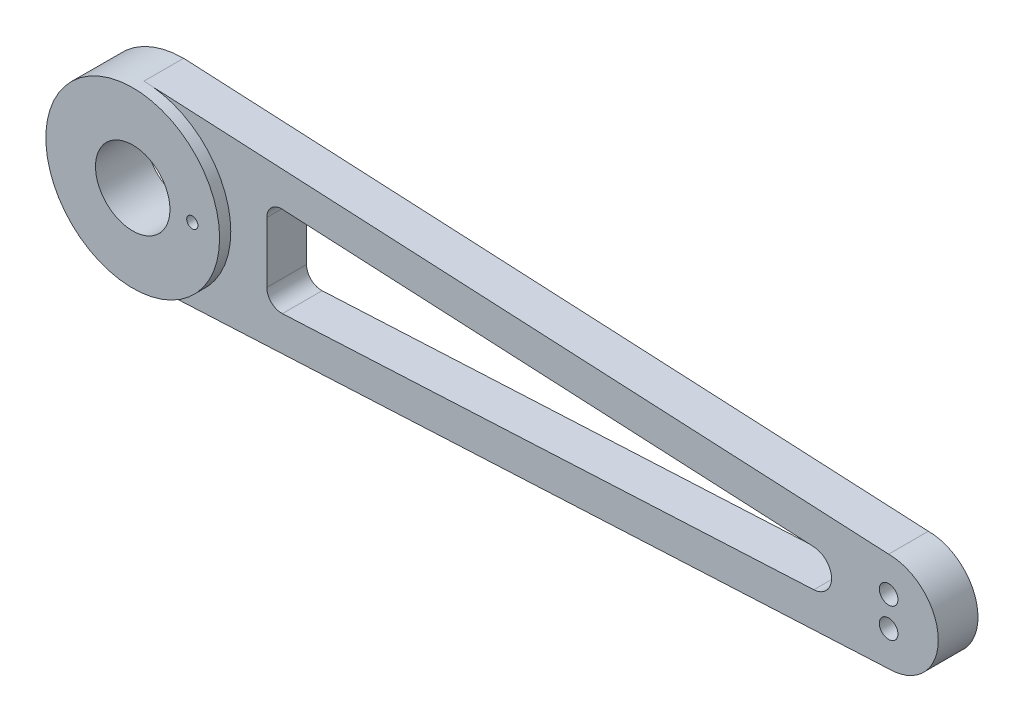
ISO-10303-21;
HEADER;
FILE_DESCRIPTION(('STEP AP214'),'2;1');
FILE_NAME('part.step','',(''),(''),'','','');
FILE_SCHEMA(('AUTOMOTIVE_DESIGN { 1 0 10303 214 1 1 1 1 }'));
ENDSEC;
DATA;
#1=APPLICATION_CONTEXT('core data for automotive mechanical design processes');
#2=APPLICATION_PROTOCOL_DEFINITION('international standard','automotive_design',2000,#1);
#3=PRODUCT_CONTEXT('',#1,'mechanical');
#4=PRODUCT('Part','Part','',(#3));
#5=PRODUCT_RELATED_PRODUCT_CATEGORY('part','',(#4));
#6=PRODUCT_DEFINITION_FORMATION('','',#4);
#7=PRODUCT_DEFINITION_CONTEXT('part definition',#1,'design');
#8=PRODUCT_DEFINITION('design','',#6,#7);
#9=PRODUCT_DEFINITION_SHAPE('','',#8);
#10=(LENGTH_UNIT() NAMED_UNIT(*) SI_UNIT(.MILLI.,.METRE.));
#11=(NAMED_UNIT(*) PLANE_ANGLE_UNIT() SI_UNIT($,.RADIAN.));
#12=(NAMED_UNIT(*) SI_UNIT($,.STERADIAN.) SOLID_ANGLE_UNIT());
#13=UNCERTAINTY_MEASURE_WITH_UNIT(LENGTH_MEASURE(1.E-05),#10,'distance_accuracy_value','');
#14=(GEOMETRIC_REPRESENTATION_CONTEXT(3) GLOBAL_UNCERTAINTY_ASSIGNED_CONTEXT((#13)) GLOBAL_UNIT_ASSIGNED_CONTEXT((#10,
#11,#12)) REPRESENTATION_CONTEXT('',''));
#15=CARTESIAN_POINT('',(0.,0.,0.));
#16=DIRECTION('',(0.,0.,1.));
#17=DIRECTION('',(1.,0.,0.));
#18=AXIS2_PLACEMENT_3D('',#15,#16,#17);
#19=CARTESIAN_POINT('',(302.25,41.,10.));
#20=DIRECTION('',(0.,0.,-1.));
#21=DIRECTION('',(-1.,0.,0.));
#22=AXIS2_PLACEMENT_3D('',#19,#20,#21);
#23=PLANE('',#22);
#24=CARTESIAN_POINT('',(300.,41.,10.));
#25=DIRECTION('',(0.,0.,1.));
#26=DIRECTION('',(1.,0.,0.));
#27=AXIS2_PLACEMENT_3D('',#24,#25,#26);
#28=CIRCLE('',#27,2.25);
#29=CARTESIAN_POINT('',(302.25,41.,10.));
#30=VERTEX_POINT('',#29);
#31=EDGE_CURVE('E19',#30,#30,#28,.F.);
#32=ORIENTED_EDGE('',*,*,#31,.T.);
#33=EDGE_LOOP('',(#32));
#34=FACE_BOUND('',#33,.T.);
#35=CARTESIAN_POINT('',(300.,41.,10.));
#36=DIRECTION('',(0.,0.,1.));
#37=DIRECTION('',(1.,0.,0.));
#38=AXIS2_PLACEMENT_3D('',#35,#36,#37);
#39=CIRCLE('',#38,3.75);
#40=CARTESIAN_POINT('',(303.75,41.,10.));
#41=VERTEX_POINT('',#40);
#42=EDGE_CURVE('E204',#41,#41,#39,.T.);
#43=ORIENTED_EDGE('',*,*,#42,.T.);
#44=EDGE_LOOP('',(#43));
#45=FACE_BOUND('',#44,.T.);
#46=ADVANCED_FACE('F16',(#34,#45),#23,.F.);
#47=CARTESIAN_POINT('',(302.25,29.,10.));
#48=DIRECTION('',(0.,0.,-1.));
#49=DIRECTION('',(-1.,0.,0.));
#50=AXIS2_PLACEMENT_3D('',#47,#48,#49);
#51=PLANE('',#50);
#52=CARTESIAN_POINT('',(300.,29.,10.));
#53=DIRECTION('',(0.,0.,1.));
#54=DIRECTION('',(1.,0.,0.));
#55=AXIS2_PLACEMENT_3D('',#52,#53,#54);
#56=CIRCLE('',#55,2.25);
#57=CARTESIAN_POINT('',(302.25,29.,10.));
#58=VERTEX_POINT('',#57);
#59=EDGE_CURVE('E206',#58,#58,#56,.F.);
#60=ORIENTED_EDGE('',*,*,#59,.T.);
#61=EDGE_LOOP('',(#60));
#62=FACE_BOUND('',#61,.T.);
#63=CARTESIAN_POINT('',(300.,29.,10.));
#64=DIRECTION('',(0.,0.,1.));
#65=DIRECTION('',(1.,0.,0.));
#66=AXIS2_PLACEMENT_3D('',#63,#64,#65);
#67=CIRCLE('',#66,3.75);
#68=CARTESIAN_POINT('',(303.75,29.,10.));
#69=VERTEX_POINT('',#68);
#70=EDGE_CURVE('E137',#69,#69,#67,.T.);
#71=ORIENTED_EDGE('',*,*,#70,.T.);
#72=EDGE_LOOP('',(#71));
#73=FACE_BOUND('',#72,.T.);
#74=ADVANCED_FACE('F219',(#62,#73),#51,.F.);
#75=CARTESIAN_POINT('',(300.,41.,16.));
#76=DIRECTION('',(0.,0.,1.));
#77=DIRECTION('',(1.,0.,0.));
#78=AXIS2_PLACEMENT_3D('',#75,#76,#77);
#79=CYLINDRICAL_SURFACE('',#78,2.25);
#80=ORIENTED_EDGE('',*,*,#31,.F.);
#81=EDGE_LOOP('',(#80));
#82=FACE_BOUND('',#81,.T.);
#83=CARTESIAN_POINT('',(300.,41.,5.));
#84=DIRECTION('',(0.,0.,1.));
#85=DIRECTION('',(1.,0.,0.));
#86=AXIS2_PLACEMENT_3D('',#83,#84,#85);
#87=CIRCLE('',#86,2.25);
#88=CARTESIAN_POINT('',(302.25,41.,5.));
#89=VERTEX_POINT('',#88);
#90=EDGE_CURVE('E136',#89,#89,#87,.T.);
#91=ORIENTED_EDGE('',*,*,#90,.F.);
#92=EDGE_LOOP('',(#91));
#93=FACE_BOUND('',#92,.T.);
#94=ADVANCED_FACE('F215',(#82,#93),#79,.F.);
#95=CARTESIAN_POINT('',(300.,29.,16.));
#96=DIRECTION('',(0.,0.,1.));
#97=DIRECTION('',(1.,0.,0.));
#98=AXIS2_PLACEMENT_3D('',#95,#96,#97);
#99=CYLINDRICAL_SURFACE('',#98,2.25);
#100=ORIENTED_EDGE('',*,*,#59,.F.);
#101=EDGE_LOOP('',(#100));
#102=FACE_BOUND('',#101,.T.);
#103=CARTESIAN_POINT('',(300.,29.,5.));
#104=DIRECTION('',(0.,0.,1.));
#105=DIRECTION('',(1.,0.,0.));
#106=AXIS2_PLACEMENT_3D('',#103,#104,#105);
#107=CIRCLE('',#106,2.25);
#108=CARTESIAN_POINT('',(302.25,29.,5.));
#109=VERTEX_POINT('',#108);
#110=EDGE_CURVE('E197',#109,#109,#107,.T.);
#111=ORIENTED_EDGE('',*,*,#110,.F.);
#112=EDGE_LOOP('',(#111));
#113=FACE_BOUND('',#112,.T.);
#114=ADVANCED_FACE('F218',(#102,#113),#99,.F.);
#115=CARTESIAN_POINT('',(24.,35.,0.));
#116=DIRECTION('',(0.,0.,-1.));
#117=DIRECTION('',(-1.,0.,0.));
#118=AXIS2_PLACEMENT_3D('',#115,#116,#117);
#119=CYLINDRICAL_SURFACE('',#118,2.25);
#120=CARTESIAN_POINT('',(24.,35.,17.1502151547998));
#121=DIRECTION('',(0.,0.,-1.));
#122=DIRECTION('',(-1.,0.,0.));
#123=AXIS2_PLACEMENT_3D('',#120,#121,#122);
#124=CIRCLE('',#123,2.25000000000273);
#125=CARTESIAN_POINT('',(21.7499999999973,35.,17.1502151547998));
#126=VERTEX_POINT('',#125);
#127=EDGE_CURVE('E133',#126,#126,#124,.T.);
#128=ORIENTED_EDGE('',*,*,#127,.T.);
#129=EDGE_LOOP('',(#128));
#130=FACE_BOUND('',#129,.T.);
#131=CARTESIAN_POINT('',(24.,35.,20.5));
#132=DIRECTION('',(0.,0.,-1.));
#133=DIRECTION('',(-1.,0.,0.));
#134=AXIS2_PLACEMENT_3D('',#131,#132,#133);
#135=CIRCLE('',#134,2.25);
#136=CARTESIAN_POINT('',(21.75,35.,20.5));
#137=VERTEX_POINT('',#136);
#138=EDGE_CURVE('E194',#137,#137,#135,.T.);
#139=ORIENTED_EDGE('',*,*,#138,.F.);
#140=EDGE_LOOP('',(#139));
#141=FACE_BOUND('',#140,.T.);
#142=ADVANCED_FACE('F312',(#130,#141),#119,.F.);
#143=CARTESIAN_POINT('',(300.,41.,16.));
#144=DIRECTION('',(0.,0.,1.));
#145=DIRECTION('',(1.,0.,0.));
#146=AXIS2_PLACEMENT_3D('',#143,#144,#145);
#147=CYLINDRICAL_SURFACE('',#146,3.75);
#148=CARTESIAN_POINT('',(300.,41.,16.));
#149=DIRECTION('',(0.,0.,1.));
#150=DIRECTION('',(1.,0.,0.));
#151=AXIS2_PLACEMENT_3D('',#148,#149,#150);
#152=CIRCLE('',#151,3.75);
#153=CARTESIAN_POINT('',(303.75,41.,16.));
#154=VERTEX_POINT('',#153);
#155=EDGE_CURVE('E191',#154,#154,#152,.T.);
#156=ORIENTED_EDGE('',*,*,#155,.T.);
#157=EDGE_LOOP('',(#156));
#158=FACE_BOUND('',#157,.T.);
#159=ORIENTED_EDGE('',*,*,#42,.F.);
#160=EDGE_LOOP('',(#159));
#161=FACE_BOUND('',#160,.T.);
#162=ADVANCED_FACE('F315',(#158,#161),#147,.F.);
#163=CARTESIAN_POINT('',(300.,29.,16.));
#164=DIRECTION('',(0.,0.,1.));
#165=DIRECTION('',(1.,0.,0.));
#166=AXIS2_PLACEMENT_3D('',#163,#164,#165);
#167=CYLINDRICAL_SURFACE('',#166,3.75);
#168=CARTESIAN_POINT('',(300.,29.,16.));
#169=DIRECTION('',(0.,0.,1.));
#170=DIRECTION('',(1.,0.,0.));
#171=AXIS2_PLACEMENT_3D('',#168,#169,#170);
#172=CIRCLE('',#171,3.75);
#173=CARTESIAN_POINT('',(303.75,29.,16.));
#174=VERTEX_POINT('',#173);
#175=EDGE_CURVE('E105',#174,#174,#172,.T.);
#176=ORIENTED_EDGE('',*,*,#175,.T.);
#177=EDGE_LOOP('',(#176));
#178=FACE_BOUND('',#177,.T.);
#179=ORIENTED_EDGE('',*,*,#70,.F.);
#180=EDGE_LOOP('',(#179));
#181=FACE_BOUND('',#180,.T.);
#182=ADVANCED_FACE('F344',(#178,#181),#167,.F.);
#183=CARTESIAN_POINT('',(300.,70.,16.));
#184=DIRECTION('',(0.,0.,-1.));
#185=DIRECTION('',(-1.,0.,0.));
#186=AXIS2_PLACEMENT_3D('',#183,#184,#185);
#187=PLANE('',#186);
#188=CARTESIAN_POINT('',(0.,35.,16.));
#189=DIRECTION('',(0.,0.,1.));
#190=DIRECTION('',(1.,0.,0.));
#191=AXIS2_PLACEMENT_3D('',#188,#189,#190);
#192=CIRCLE('',#191,35.);
#193=CARTESIAN_POINT('',(3.49127182044882,69.8254364089776,16.));
#194=VERTEX_POINT('',#193);
#195=CARTESIAN_POINT('',(0.,70.,16.));
#196=VERTEX_POINT('',#195);
#197=EDGE_CURVE('E130',#194,#196,#192,.T.);
#198=ORIENTED_EDGE('',*,*,#197,.F.);
#199=DIRECTION('',(0.998752338877845,-0.0499376169438922,0.));
#200=VECTOR('',#199,1.);
#201=CARTESIAN_POINT('',(0.,70.,16.));
#202=LINE('',#201,#200);
#203=EDGE_CURVE('E129',#194,#196,#202,.F.);
#204=ORIENTED_EDGE('',*,*,#203,.T.);
#205=EDGE_LOOP('',(#198,#204));
#206=FACE_BOUND('',#205,.T.);
#207=ADVANCED_FACE('F341',(#206),#187,.T.);
#208=CARTESIAN_POINT('',(300.,0.,16.));
#209=DIRECTION('',(0.,0.,1.));
#210=DIRECTION('',(1.,0.,0.));
#211=AXIS2_PLACEMENT_3D('',#208,#209,#210);
#212=PLANE('',#211);
#213=CARTESIAN_POINT('',(0.,35.,16.));
#214=DIRECTION('',(0.,0.,1.));
#215=DIRECTION('',(1.,0.,0.));
#216=AXIS2_PLACEMENT_3D('',#213,#214,#215);
#217=CIRCLE('',#216,35.);
#218=CARTESIAN_POINT('',(0.,0.,16.));
#219=VERTEX_POINT('',#218);
#220=CARTESIAN_POINT('',(3.49127182044891,0.174563591022445,16.));
#221=VERTEX_POINT('',#220);
#222=EDGE_CURVE('E97',#219,#221,#217,.T.);
#223=ORIENTED_EDGE('',*,*,#222,.F.);
#224=DIRECTION('',(-0.998752338877845,-0.0499376169438922,0.));
#225=VECTOR('',#224,1.);
#226=CARTESIAN_POINT('',(0.,0.,16.));
#227=LINE('',#226,#225);
#228=EDGE_CURVE('E101',#219,#221,#227,.F.);
#229=ORIENTED_EDGE('',*,*,#228,.T.);
#230=EDGE_LOOP('',(#223,#229));
#231=FACE_BOUND('',#230,.T.);
#232=ADVANCED_FACE('F99',(#231),#212,.F.);
#233=CARTESIAN_POINT('',(24.,35.,17.0000000001664));
#234=DIRECTION('',(0.,0.,-1.));
#235=DIRECTION('',(-1.,0.,0.));
#236=AXIS2_PLACEMENT_3D('',#233,#234,#235);
#237=CONICAL_SURFACE('',#236,2.49999999976944,1.0297442585949);
#238=CARTESIAN_POINT('',(24.,35.,17.));
#239=DIRECTION('',(0.,0.,-1.));
#240=DIRECTION('',(-1.,0.,0.));
#241=AXIS2_PLACEMENT_3D('',#238,#239,#240);
#242=CIRCLE('',#241,2.5);
#243=CARTESIAN_POINT('',(21.5,35.,17.));
#244=VERTEX_POINT('',#243);
#245=EDGE_CURVE('E179',#244,#244,#242,.T.);
#246=ORIENTED_EDGE('',*,*,#245,.T.);
#247=EDGE_LOOP('',(#246));
#248=FACE_BOUND('',#247,.T.);
#249=ORIENTED_EDGE('',*,*,#127,.F.);
#250=EDGE_LOOP('',(#249));
#251=FACE_BOUND('',#250,.T.);
#252=ADVANCED_FACE('F227',(#248,#251),#237,.F.);
#253=CARTESIAN_POINT('',(300.,35.,5.));
#254=DIRECTION('',(0.,0.,-1.));
#255=DIRECTION('',(-1.,0.,0.));
#256=AXIS2_PLACEMENT_3D('',#253,#254,#255);
#257=PLANE('',#256);
#258=ORIENTED_EDGE('',*,*,#110,.T.);
#259=EDGE_LOOP('',(#258));
#260=FACE_BOUND('',#259,.T.);
#261=ORIENTED_EDGE('',*,*,#90,.T.);
#262=EDGE_LOOP('',(#261));
#263=FACE_BOUND('',#262,.T.);
#264=CARTESIAN_POINT('',(300.,35.,5.));
#265=DIRECTION('',(0.,0.,-1.));
#266=DIRECTION('',(-1.,0.,0.));
#267=AXIS2_PLACEMENT_3D('',#264,#265,#266);
#268=CIRCLE('',#267,12.);
#269=CARTESIAN_POINT('',(288.,35.,5.));
#270=VERTEX_POINT('',#269);
#271=EDGE_CURVE('E176',#270,#270,#268,.T.);
#272=ORIENTED_EDGE('',*,*,#271,.T.);
#273=EDGE_LOOP('',(#272));
#274=FACE_BOUND('',#273,.T.);
#275=ADVANCED_FACE('F223',(#260,#263,#274),#257,.T.);
#276=CARTESIAN_POINT('',(0.,35.,20.5));
#277=DIRECTION('',(0.,0.,1.));
#278=DIRECTION('',(1.,0.,0.));
#279=AXIS2_PLACEMENT_3D('',#276,#277,#278);
#280=PLANE('',#279);
#281=CARTESIAN_POINT('',(0.,35.,20.5));
#282=DIRECTION('',(0.,0.,1.));
#283=DIRECTION('',(1.,0.,0.));
#284=AXIS2_PLACEMENT_3D('',#281,#282,#283);
#285=CIRCLE('',#284,15.);
#286=CARTESIAN_POINT('',(15.,35.,20.5));
#287=VERTEX_POINT('',#286);
#288=EDGE_CURVE('E173',#287,#287,#285,.F.);
#289=ORIENTED_EDGE('',*,*,#288,.T.);
#290=EDGE_LOOP('',(#289));
#291=FACE_BOUND('',#290,.T.);
#292=ORIENTED_EDGE('',*,*,#138,.T.);
#293=EDGE_LOOP('',(#292));
#294=FACE_BOUND('',#293,.T.);
#295=CARTESIAN_POINT('',(0.,35.,20.5));
#296=DIRECTION('',(0.,0.,1.));
#297=DIRECTION('',(1.,0.,0.));
#298=AXIS2_PLACEMENT_3D('',#295,#296,#297);
#299=CIRCLE('',#298,35.);
#300=CARTESIAN_POINT('',(35.,35.,20.5));
#301=VERTEX_POINT('',#300);
#302=EDGE_CURVE('E104',#301,#301,#299,.F.);
#303=ORIENTED_EDGE('',*,*,#302,.F.);
#304=EDGE_LOOP('',(#303));
#305=FACE_BOUND('',#304,.T.);
#306=ADVANCED_FACE('F226',(#291,#294,#305),#280,.T.);
#307=CARTESIAN_POINT('',(0.,70.,16.));
#308=DIRECTION('',(0.,0.,-1.));
#309=DIRECTION('',(-1.,0.,0.));
#310=AXIS2_PLACEMENT_3D('',#307,#308,#309);
#311=PLANE('',#310);
#312=DIRECTION('',(0.,1.,0.));
#313=VECTOR('',#312,1.);
#314=CARTESIAN_POINT('',(49.5,53.50751092385,16.));
#315=LINE('',#314,#313);
#316=CARTESIAN_POINT('',(49.5,22.7999843945,16.));
#317=VERTEX_POINT('',#316);
#318=CARTESIAN_POINT('',(49.5,47.2000156055,16.));
#319=VERTEX_POINT('',#318);
#320=EDGE_CURVE('E301',#317,#319,#315,.T.);
#321=ORIENTED_EDGE('',*,*,#320,.T.);
#322=CARTESIAN_POINT('',(55.5,47.2000156055,16.));
#323=DIRECTION('',(0.,0.,-1.));
#324=DIRECTION('',(-1.,0.,0.));
#325=AXIS2_PLACEMENT_3D('',#322,#323,#324);
#326=CIRCLE('',#325,6.);
#327=CARTESIAN_POINT('',(55.7996257016616,53.192529638767,16.));
#328=VERTEX_POINT('',#327);
#329=EDGE_CURVE('E162',#319,#328,#326,.T.);
#330=ORIENTED_EDGE('',*,*,#329,.T.);
#331=DIRECTION('',(-0.998752338877845,0.0499376169438922,0.));
#332=VECTOR('',#331,1.);
#333=CARTESIAN_POINT('',(49.5,53.50751092385,16.));
#334=LINE('',#333,#332);
#335=CARTESIAN_POINT('',(269.874439447587,42.4887889514707,16.));
#336=VERTEX_POINT('',#335);
#337=EDGE_CURVE('E168',#328,#336,#334,.F.);
#338=ORIENTED_EDGE('',*,*,#337,.T.);
#339=CARTESIAN_POINT('',(269.5,35.,16.));
#340=DIRECTION('',(0.,0.,1.));
#341=DIRECTION('',(1.,0.,0.));
#342=AXIS2_PLACEMENT_3D('',#339,#340,#341);
#343=CIRCLE('',#342,7.498144094346);
#344=CARTESIAN_POINT('',(269.874439447587,27.5112110485294,16.));
#345=VERTEX_POINT('',#344);
#346=EDGE_CURVE('E166',#336,#345,#343,.F.);
#347=ORIENTED_EDGE('',*,*,#346,.T.);
#348=DIRECTION('',(0.998752338877845,0.0499376169438922,0.));
#349=VECTOR('',#348,1.);
#350=CARTESIAN_POINT('',(49.5,16.49248907615,16.));
#351=LINE('',#350,#349);
#352=CARTESIAN_POINT('',(55.7996257016616,16.8074703612331,16.));
#353=VERTEX_POINT('',#352);
#354=EDGE_CURVE('E172',#345,#353,#351,.F.);
#355=ORIENTED_EDGE('',*,*,#354,.T.);
#356=CARTESIAN_POINT('',(55.5,22.7999843945,16.));
#357=DIRECTION('',(0.,0.,-1.));
#358=DIRECTION('',(-1.,0.,0.));
#359=AXIS2_PLACEMENT_3D('',#356,#357,#358);
#360=CIRCLE('',#359,6.);
#361=EDGE_CURVE('E170',#353,#317,#360,.T.);
#362=ORIENTED_EDGE('',*,*,#361,.T.);
#363=EDGE_LOOP('',(#321,#330,#338,#347,#355,#362));
#364=FACE_BOUND('',#363,.T.);
#365=ORIENTED_EDGE('',*,*,#175,.F.);
#366=EDGE_LOOP('',(#365));
#367=FACE_BOUND('',#366,.T.);
#368=ORIENTED_EDGE('',*,*,#155,.F.);
#369=EDGE_LOOP('',(#368));
#370=FACE_BOUND('',#369,.T.);
#371=CARTESIAN_POINT('',(300.,35.,16.));
#372=DIRECTION('',(0.,0.,1.));
#373=DIRECTION('',(1.,0.,0.));
#374=AXIS2_PLACEMENT_3D('',#371,#372,#373);
#375=CIRCLE('',#374,20.);
#376=CARTESIAN_POINT('',(300.,55.,16.));
#377=VERTEX_POINT('',#376);
#378=CARTESIAN_POINT('',(300.,15.,16.));
#379=VERTEX_POINT('',#378);
#380=EDGE_CURVE('E115',#377,#379,#375,.F.);
#381=ORIENTED_EDGE('',*,*,#380,.F.);
#382=DIRECTION('',(0.998752338877845,-0.0499376169438922,0.));
#383=VECTOR('',#382,1.);
#384=CARTESIAN_POINT('',(0.,70.,16.));
#385=LINE('',#384,#383);
#386=EDGE_CURVE('E126',#377,#194,#385,.F.);
#387=ORIENTED_EDGE('',*,*,#386,.T.);
#388=CARTESIAN_POINT('',(0.,35.,16.));
#389=DIRECTION('',(0.,0.,1.));
#390=DIRECTION('',(1.,0.,0.));
#391=AXIS2_PLACEMENT_3D('',#388,#389,#390);
#392=CIRCLE('',#391,35.);
#393=EDGE_CURVE('E185',#221,#194,#392,.T.);
#394=ORIENTED_EDGE('',*,*,#393,.F.);
#395=DIRECTION('',(-0.998752338877845,-0.0499376169438922,0.));
#396=VECTOR('',#395,1.);
#397=CARTESIAN_POINT('',(0.,0.,16.));
#398=LINE('',#397,#396);
#399=EDGE_CURVE('E120',#221,#379,#398,.F.);
#400=ORIENTED_EDGE('',*,*,#399,.T.);
#401=EDGE_LOOP('',(#381,#387,#394,#400));
#402=FACE_BOUND('',#401,.T.);
#403=ADVANCED_FACE('F321',(#364,#367,#370,#402),#311,.F.);
#404=CARTESIAN_POINT('',(0.,35.,0.));
#405=DIRECTION('',(0.,0.,1.));
#406=DIRECTION('',(1.,0.,0.));
#407=AXIS2_PLACEMENT_3D('',#404,#405,#406);
#408=CYLINDRICAL_SURFACE('',#407,35.);
#409=ORIENTED_EDGE('',*,*,#302,.T.);
#410=EDGE_LOOP('',(#409));
#411=FACE_BOUND('',#410,.T.);
#412=DIRECTION('',(0.,0.,1.));
#413=VECTOR('',#412,1.);
#414=CARTESIAN_POINT('',(0.,70.,-2.500000000072E-05));
#415=LINE('',#414,#413);
#416=CARTESIAN_POINT('',(0.,70.,0.));
#417=VERTEX_POINT('',#416);
#418=EDGE_CURVE('E132',#196,#417,#415,.F.);
#419=ORIENTED_EDGE('',*,*,#418,.T.);
#420=CARTESIAN_POINT('',(0.,35.,0.));
#421=DIRECTION('',(0.,0.,1.));
#422=DIRECTION('',(1.,0.,0.));
#423=AXIS2_PLACEMENT_3D('',#420,#421,#422);
#424=CIRCLE('',#423,35.);
#425=CARTESIAN_POINT('',(0.,0.,0.));
#426=VERTEX_POINT('',#425);
#427=EDGE_CURVE('E111',#426,#417,#424,.F.);
#428=ORIENTED_EDGE('',*,*,#427,.F.);
#429=DIRECTION('',(0.,0.,1.));
#430=VECTOR('',#429,1.);
#431=CARTESIAN_POINT('',(0.,0.,-2.500000000072E-05));
#432=LINE('',#431,#430);
#433=EDGE_CURVE('E108',#426,#219,#432,.T.);
#434=ORIENTED_EDGE('',*,*,#433,.T.);
#435=ORIENTED_EDGE('',*,*,#222,.T.);
#436=ORIENTED_EDGE('',*,*,#393,.T.);
#437=ORIENTED_EDGE('',*,*,#197,.T.);
#438=EDGE_LOOP('',(#419,#428,#434,#435,#436,#437));
#439=FACE_BOUND('',#438,.T.);
#440=ADVANCED_FACE('F110',(#411,#439),#408,.T.);
#441=CARTESIAN_POINT('',(0.,70.,-2.500000000072E-05));
#442=DIRECTION('',(-0.0499376169438922,-0.998752338877845,0.));
#443=DIRECTION('',(0.998752338877845,-0.0499376169438922,0.));
#444=AXIS2_PLACEMENT_3D('',#441,#442,#443);
#445=PLANE('',#444);
#446=ORIENTED_EDGE('',*,*,#203,.F.);
#447=ORIENTED_EDGE('',*,*,#386,.F.);
#448=DIRECTION('',(0.,0.,1.));
#449=VECTOR('',#448,1.);
#450=CARTESIAN_POINT('',(300.,55.,0.));
#451=LINE('',#450,#449);
#452=CARTESIAN_POINT('',(300.,55.,0.));
#453=VERTEX_POINT('',#452);
#454=EDGE_CURVE('E182',#453,#377,#451,.T.);
#455=ORIENTED_EDGE('',*,*,#454,.F.);
#456=DIRECTION('',(0.998752338877845,-0.0499376169438923,0.));
#457=VECTOR('',#456,1.);
#458=CARTESIAN_POINT('',(0.,70.,0.));
#459=LINE('',#458,#457);
#460=EDGE_CURVE('E159',#417,#453,#459,.T.);
#461=ORIENTED_EDGE('',*,*,#460,.F.);
#462=ORIENTED_EDGE('',*,*,#418,.F.);
#463=EDGE_LOOP('',(#446,#447,#455,#461,#462));
#464=FACE_BOUND('',#463,.T.);
#465=ADVANCED_FACE('F327',(#464),#445,.F.);
#466=CARTESIAN_POINT('',(300.,35.,0.));
#467=DIRECTION('',(0.,0.,1.));
#468=DIRECTION('',(1.,0.,0.));
#469=AXIS2_PLACEMENT_3D('',#466,#467,#468);
#470=CYLINDRICAL_SURFACE('',#469,20.);
#471=DIRECTION('',(0.,0.,1.));
#472=VECTOR('',#471,1.);
#473=CARTESIAN_POINT('',(300.,15.,-2.500000000072E-05));
#474=LINE('',#473,#472);
#475=CARTESIAN_POINT('',(300.,15.,0.));
#476=VERTEX_POINT('',#475);
#477=EDGE_CURVE('E122',#379,#476,#474,.F.);
#478=ORIENTED_EDGE('',*,*,#477,.T.);
#479=CARTESIAN_POINT('',(300.,35.,0.));
#480=DIRECTION('',(0.,0.,1.));
#481=DIRECTION('',(1.,0.,0.));
#482=AXIS2_PLACEMENT_3D('',#479,#480,#481);
#483=CIRCLE('',#482,20.);
#484=EDGE_CURVE('E157',#453,#476,#483,.F.);
#485=ORIENTED_EDGE('',*,*,#484,.F.);
#486=ORIENTED_EDGE('',*,*,#454,.T.);
#487=ORIENTED_EDGE('',*,*,#380,.T.);
#488=EDGE_LOOP('',(#478,#485,#486,#487));
#489=FACE_BOUND('',#488,.T.);
#490=ADVANCED_FACE('F333',(#489),#470,.T.);
#491=CARTESIAN_POINT('',(0.,0.,-2.500000000072E-05));
#492=DIRECTION('',(-0.0499376169438922,0.998752338877845,0.));
#493=DIRECTION('',(-0.998752338877845,-0.0499376169438922,0.));
#494=AXIS2_PLACEMENT_3D('',#491,#492,#493);
#495=PLANE('',#494);
#496=ORIENTED_EDGE('',*,*,#399,.F.);
#497=ORIENTED_EDGE('',*,*,#228,.F.);
#498=ORIENTED_EDGE('',*,*,#433,.F.);
#499=DIRECTION('',(-0.998752338877845,-0.0499376169438922,0.));
#500=VECTOR('',#499,1.);
#501=CARTESIAN_POINT('',(300.,15.,0.));
#502=LINE('',#501,#500);
#503=EDGE_CURVE('E156',#476,#426,#502,.T.);
#504=ORIENTED_EDGE('',*,*,#503,.F.);
#505=ORIENTED_EDGE('',*,*,#477,.F.);
#506=EDGE_LOOP('',(#496,#497,#498,#504,#505));
#507=FACE_BOUND('',#506,.T.);
#508=ADVANCED_FACE('F118',(#507),#495,.F.);
#509=CARTESIAN_POINT('',(24.,35.,0.));
#510=DIRECTION('',(0.,0.,-1.));
#511=DIRECTION('',(-1.,0.,0.));
#512=AXIS2_PLACEMENT_3D('',#509,#510,#511);
#513=CYLINDRICAL_SURFACE('',#512,2.5);
#514=CARTESIAN_POINT('',(24.,35.,0.));
#515=DIRECTION('',(0.,0.,-1.));
#516=DIRECTION('',(-1.,0.,0.));
#517=AXIS2_PLACEMENT_3D('',#514,#515,#516);
#518=CIRCLE('',#517,2.5);
#519=CARTESIAN_POINT('',(21.5,35.,0.));
#520=VERTEX_POINT('',#519);
#521=EDGE_CURVE('E153',#520,#520,#518,.F.);
#522=ORIENTED_EDGE('',*,*,#521,.F.);
#523=EDGE_LOOP('',(#522));
#524=FACE_BOUND('',#523,.T.);
#525=ORIENTED_EDGE('',*,*,#245,.F.);
#526=EDGE_LOOP('',(#525));
#527=FACE_BOUND('',#526,.T.);
#528=ADVANCED_FACE('F235',(#524,#527),#513,.F.);
#529=CARTESIAN_POINT('',(300.,35.,5.));
#530=DIRECTION('',(0.,0.,-1.));
#531=DIRECTION('',(-1.,0.,0.));
#532=AXIS2_PLACEMENT_3D('',#529,#530,#531);
#533=CYLINDRICAL_SURFACE('',#532,12.);
#534=CARTESIAN_POINT('',(300.,35.,0.));
#535=DIRECTION('',(0.,0.,-1.));
#536=DIRECTION('',(-1.,0.,0.));
#537=AXIS2_PLACEMENT_3D('',#534,#535,#536);
#538=CIRCLE('',#537,12.);
#539=CARTESIAN_POINT('',(288.,35.,0.));
#540=VERTEX_POINT('',#539);
#541=EDGE_CURVE('E150',#540,#540,#538,.F.);
#542=ORIENTED_EDGE('',*,*,#541,.F.);
#543=EDGE_LOOP('',(#542));
#544=FACE_BOUND('',#543,.T.);
#545=ORIENTED_EDGE('',*,*,#271,.F.);
#546=EDGE_LOOP('',(#545));
#547=FACE_BOUND('',#546,.T.);
#548=ADVANCED_FACE('F232',(#544,#547),#533,.F.);
#549=CARTESIAN_POINT('',(0.,35.,-0.0001400000000026));
#550=DIRECTION('',(0.,0.,1.));
#551=DIRECTION('',(1.,0.,0.));
#552=AXIS2_PLACEMENT_3D('',#549,#550,#551);
#553=CYLINDRICAL_SURFACE('',#552,15.);
#554=ORIENTED_EDGE('',*,*,#288,.F.);
#555=EDGE_LOOP('',(#554));
#556=FACE_BOUND('',#555,.T.);
#557=CARTESIAN_POINT('',(0.,35.,0.));
#558=DIRECTION('',(0.,0.,1.));
#559=DIRECTION('',(1.,0.,0.));
#560=AXIS2_PLACEMENT_3D('',#557,#558,#559);
#561=CIRCLE('',#560,15.);
#562=CARTESIAN_POINT('',(15.,35.,0.));
#563=VERTEX_POINT('',#562);
#564=EDGE_CURVE('E147',#563,#563,#561,.T.);
#565=ORIENTED_EDGE('',*,*,#564,.F.);
#566=EDGE_LOOP('',(#565));
#567=FACE_BOUND('',#566,.T.);
#568=ADVANCED_FACE('F234',(#556,#567),#553,.F.);
#569=CARTESIAN_POINT('',(55.5,22.7999843945,-0.0001400000000026));
#570=DIRECTION('',(0.,0.,-1.));
#571=DIRECTION('',(-1.,0.,0.));
#572=AXIS2_PLACEMENT_3D('',#569,#570,#571);
#573=CYLINDRICAL_SURFACE('',#572,6.);
#574=ORIENTED_EDGE('',*,*,#361,.F.);
#575=DIRECTION('',(0.,0.,1.));
#576=VECTOR('',#575,1.);
#577=CARTESIAN_POINT('',(55.7996257016598,16.807470361233,-0.0001400000000026));
#578=LINE('',#577,#576);
#579=CARTESIAN_POINT('',(55.7996257016617,16.8074703612316,0.));
#580=VERTEX_POINT('',#579);
#581=EDGE_CURVE('E283',#353,#580,#578,.F.);
#582=ORIENTED_EDGE('',*,*,#581,.T.);
#583=CARTESIAN_POINT('',(55.5,22.7999843945,0.));
#584=DIRECTION('',(0.,0.,-1.));
#585=DIRECTION('',(-1.,0.,0.));
#586=AXIS2_PLACEMENT_3D('',#583,#584,#585);
#587=CIRCLE('',#586,6.);
#588=CARTESIAN_POINT('',(49.5,22.7999843945,0.));
#589=VERTEX_POINT('',#588);
#590=EDGE_CURVE('E144',#589,#580,#587,.F.);
#591=ORIENTED_EDGE('',*,*,#590,.F.);
#592=DIRECTION('',(0.,0.,1.));
#593=VECTOR('',#592,1.);
#594=CARTESIAN_POINT('',(49.5,22.7999843945,-0.0001400000000026));
#595=LINE('',#594,#593);
#596=EDGE_CURVE('E161',#589,#317,#595,.T.);
#597=ORIENTED_EDGE('',*,*,#596,.T.);
#598=EDGE_LOOP('',(#574,#582,#591,#597));
#599=FACE_BOUND('',#598,.T.);
#600=ADVANCED_FACE('F243',(#599),#573,.F.);
#601=CARTESIAN_POINT('',(49.5,16.49248907615,-0.0001400000000026));
#602=DIRECTION('',(0.0499376169438922,-0.998752338877845,0.));
#603=DIRECTION('',(0.998752338877845,0.0499376169438922,0.));
#604=AXIS2_PLACEMENT_3D('',#601,#602,#603);
#605=PLANE('',#604);
#606=ORIENTED_EDGE('',*,*,#354,.F.);
#607=DIRECTION('',(0.,0.,1.));
#608=VECTOR('',#607,1.);
#609=CARTESIAN_POINT('',(269.8744394476,27.5112110485302,-0.0001400000000026));
#610=LINE('',#609,#608);
#611=CARTESIAN_POINT('',(269.874439447587,27.5112110485294,0.));
#612=VERTEX_POINT('',#611);
#613=EDGE_CURVE('E169',#345,#612,#610,.F.);
#614=ORIENTED_EDGE('',*,*,#613,.T.);
#615=DIRECTION('',(0.998752338877844,0.0499376169439062,0.));
#616=VECTOR('',#615,1.);
#617=CARTESIAN_POINT('',(55.79962570166,16.80747036123,0.));
#618=LINE('',#617,#616);
#619=EDGE_CURVE('E143',#580,#612,#618,.T.);
#620=ORIENTED_EDGE('',*,*,#619,.F.);
#621=ORIENTED_EDGE('',*,*,#581,.F.);
#622=EDGE_LOOP('',(#606,#614,#620,#621));
#623=FACE_BOUND('',#622,.T.);
#624=ADVANCED_FACE('F271',(#623),#605,.F.);
#625=CARTESIAN_POINT('',(269.5,35.,-0.0001400000000026));
#626=DIRECTION('',(0.,0.,1.));
#627=DIRECTION('',(1.,0.,0.));
#628=AXIS2_PLACEMENT_3D('',#625,#626,#627);
#629=CYLINDRICAL_SURFACE('',#628,7.498144094346);
#630=ORIENTED_EDGE('',*,*,#346,.F.);
#631=DIRECTION('',(0.,0.,1.));
#632=VECTOR('',#631,1.);
#633=CARTESIAN_POINT('',(269.8744394476,42.48878895147,-0.0001400000000026));
#634=LINE('',#633,#632);
#635=CARTESIAN_POINT('',(269.874439447587,42.4887889514707,0.));
#636=VERTEX_POINT('',#635);
#637=EDGE_CURVE('E165',#336,#636,#634,.F.);
#638=ORIENTED_EDGE('',*,*,#637,.T.);
#639=CARTESIAN_POINT('',(269.5,35.,0.));
#640=DIRECTION('',(0.,0.,1.));
#641=DIRECTION('',(1.,0.,0.));
#642=AXIS2_PLACEMENT_3D('',#639,#640,#641);
#643=CIRCLE('',#642,7.498144094346);
#644=EDGE_CURVE('E141',#612,#636,#643,.T.);
#645=ORIENTED_EDGE('',*,*,#644,.F.);
#646=ORIENTED_EDGE('',*,*,#613,.F.);
#647=EDGE_LOOP('',(#630,#638,#645,#646));
#648=FACE_BOUND('',#647,.T.);
#649=ADVANCED_FACE('F267',(#648),#629,.F.);
#650=CARTESIAN_POINT('',(49.5,53.50751092385,-0.0001400000000026));
#651=DIRECTION('',(0.0499376169438922,0.998752338877845,0.));
#652=DIRECTION('',(-0.998752338877845,0.0499376169438922,0.));
#653=AXIS2_PLACEMENT_3D('',#650,#651,#652);
#654=PLANE('',#653);
#655=DIRECTION('',(-0.998752338877844,0.0499376169439062,0.));
#656=VECTOR('',#655,1.);
#657=CARTESIAN_POINT('',(269.8744394476,42.48878895147,0.));
#658=LINE('',#657,#656);
#659=CARTESIAN_POINT('',(55.7996257016617,53.1925296387685,0.));
#660=VERTEX_POINT('',#659);
#661=EDGE_CURVE('E140',#636,#660,#658,.T.);
#662=ORIENTED_EDGE('',*,*,#661,.F.);
#663=ORIENTED_EDGE('',*,*,#637,.F.);
#664=ORIENTED_EDGE('',*,*,#337,.F.);
#665=DIRECTION('',(0.,0.,-1.));
#666=VECTOR('',#665,1.);
#667=CARTESIAN_POINT('',(55.7996257016599,53.1925296387672,-0.0001400000000026));
#668=LINE('',#667,#666);
#669=EDGE_CURVE('E164',#328,#660,#668,.T.);
#670=ORIENTED_EDGE('',*,*,#669,.T.);
#671=EDGE_LOOP('',(#662,#663,#664,#670));
#672=FACE_BOUND('',#671,.T.);
#673=ADVANCED_FACE('F264',(#672),#654,.F.);
#674=CARTESIAN_POINT('',(55.5,47.2000156055,-0.0001400000000026));
#675=DIRECTION('',(0.,0.,-1.));
#676=DIRECTION('',(-1.,0.,0.));
#677=AXIS2_PLACEMENT_3D('',#674,#675,#676);
#678=CYLINDRICAL_SURFACE('',#677,6.);
#679=ORIENTED_EDGE('',*,*,#329,.F.);
#680=DIRECTION('',(0.,0.,1.));
#681=VECTOR('',#680,1.);
#682=CARTESIAN_POINT('',(49.5,47.2000156055,-0.0001400000000026));
#683=LINE('',#682,#681);
#684=CARTESIAN_POINT('',(49.5,47.2000156055,0.));
#685=VERTEX_POINT('',#684);
#686=EDGE_CURVE('E34',#319,#685,#683,.F.);
#687=ORIENTED_EDGE('',*,*,#686,.T.);
#688=CARTESIAN_POINT('',(55.5,47.2000156055,0.));
#689=DIRECTION('',(0.,0.,-1.));
#690=DIRECTION('',(-1.,0.,0.));
#691=AXIS2_PLACEMENT_3D('',#688,#689,#690);
#692=CIRCLE('',#691,6.);
#693=EDGE_CURVE('E25',#660,#685,#692,.F.);
#694=ORIENTED_EDGE('',*,*,#693,.F.);
#695=ORIENTED_EDGE('',*,*,#669,.F.);
#696=EDGE_LOOP('',(#679,#687,#694,#695));
#697=FACE_BOUND('',#696,.T.);
#698=ADVANCED_FACE('F257',(#697),#678,.F.);
#699=CARTESIAN_POINT('',(49.5,53.50751092385,-0.0001400000000026));
#700=DIRECTION('',(-1.,0.,0.));
#701=DIRECTION('',(0.,0.,1.));
#702=AXIS2_PLACEMENT_3D('',#699,#700,#701);
#703=PLANE('',#702);
#704=DIRECTION('',(0.,1.,0.));
#705=VECTOR('',#704,1.);
#706=CARTESIAN_POINT('',(49.5,70.,0.));
#707=LINE('',#706,#705);
#708=EDGE_CURVE('E11',#685,#589,#707,.F.);
#709=ORIENTED_EDGE('',*,*,#708,.F.);
#710=ORIENTED_EDGE('',*,*,#686,.F.);
#711=ORIENTED_EDGE('',*,*,#320,.F.);
#712=ORIENTED_EDGE('',*,*,#596,.F.);
#713=EDGE_LOOP('',(#709,#710,#711,#712));
#714=FACE_BOUND('',#713,.T.);
#715=ADVANCED_FACE('F251',(#714),#703,.F.);
#716=CARTESIAN_POINT('',(0.,70.,0.));
#717=DIRECTION('',(0.,0.,-1.));
#718=DIRECTION('',(-1.,0.,0.));
#719=AXIS2_PLACEMENT_3D('',#716,#717,#718);
#720=PLANE('',#719);
#721=ORIENTED_EDGE('',*,*,#693,.T.);
#722=ORIENTED_EDGE('',*,*,#708,.T.);
#723=ORIENTED_EDGE('',*,*,#590,.T.);
#724=ORIENTED_EDGE('',*,*,#619,.T.);
#725=ORIENTED_EDGE('',*,*,#644,.T.);
#726=ORIENTED_EDGE('',*,*,#661,.T.);
#727=EDGE_LOOP('',(#721,#722,#723,#724,#725,#726));
#728=FACE_BOUND('',#727,.T.);
#729=ORIENTED_EDGE('',*,*,#564,.T.);
#730=EDGE_LOOP('',(#729));
#731=FACE_BOUND('',#730,.T.);
#732=ORIENTED_EDGE('',*,*,#541,.T.);
#733=EDGE_LOOP('',(#732));
#734=FACE_BOUND('',#733,.T.);
#735=ORIENTED_EDGE('',*,*,#521,.T.);
#736=EDGE_LOOP('',(#735));
#737=FACE_BOUND('',#736,.T.);
#738=ORIENTED_EDGE('',*,*,#484,.T.);
#739=ORIENTED_EDGE('',*,*,#503,.T.);
#740=ORIENTED_EDGE('',*,*,#427,.T.);
#741=ORIENTED_EDGE('',*,*,#460,.T.);
#742=EDGE_LOOP('',(#738,#739,#740,#741));
#743=FACE_BOUND('',#742,.T.);
#744=ADVANCED_FACE('F249',(#728,#731,#734,#737,#743),#720,.T.);
#745=CLOSED_SHELL('',(#46,#74,#94,#114,#142,#162,#182,#207,#232,#252,#275,#306,#403,#440,#465,
#490,#508,#528,#548,#568,#600,#624,#649,#673,#698,#715,#744));
#746=MANIFOLD_SOLID_BREP('B1',#745);
#747=ADVANCED_BREP_SHAPE_REPRESENTATION('',(#18,#746),#14);
#748=SHAPE_DEFINITION_REPRESENTATION(#9,#747);
ENDSEC;
END-ISO-10303-21;
